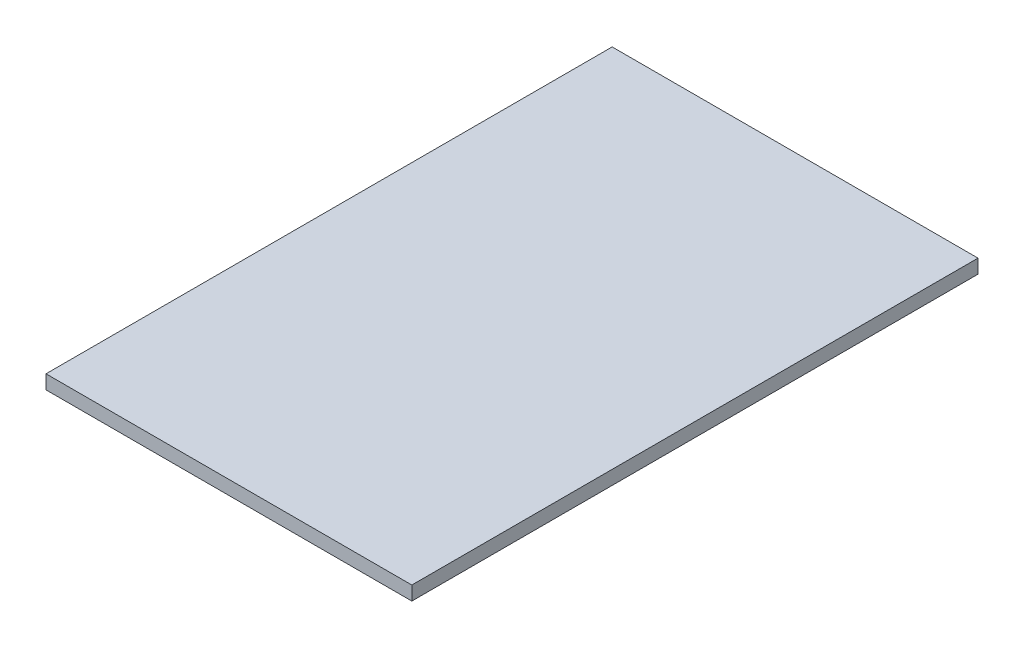
ISO-10303-21;
HEADER;
FILE_DESCRIPTION(('STEP AP214'),'2;1');
FILE_NAME('part.step','',(''),(''),'','','');
FILE_SCHEMA(('AUTOMOTIVE_DESIGN { 1 0 10303 214 1 1 1 1 }'));
ENDSEC;
DATA;
#1=APPLICATION_CONTEXT('core data for automotive mechanical design processes');
#2=APPLICATION_PROTOCOL_DEFINITION('international standard','automotive_design',2000,#1);
#3=PRODUCT_CONTEXT('',#1,'mechanical');
#4=PRODUCT('Part','Part','',(#3));
#5=PRODUCT_RELATED_PRODUCT_CATEGORY('part','',(#4));
#6=PRODUCT_DEFINITION_FORMATION('','',#4);
#7=PRODUCT_DEFINITION_CONTEXT('part definition',#1,'design');
#8=PRODUCT_DEFINITION('design','',#6,#7);
#9=PRODUCT_DEFINITION_SHAPE('','',#8);
#10=(LENGTH_UNIT() NAMED_UNIT(*) SI_UNIT(.MILLI.,.METRE.));
#11=(NAMED_UNIT(*) PLANE_ANGLE_UNIT() SI_UNIT($,.RADIAN.));
#12=(NAMED_UNIT(*) SI_UNIT($,.STERADIAN.) SOLID_ANGLE_UNIT());
#13=UNCERTAINTY_MEASURE_WITH_UNIT(LENGTH_MEASURE(1.E-05),#10,'distance_accuracy_value','');
#14=(GEOMETRIC_REPRESENTATION_CONTEXT(3) GLOBAL_UNCERTAINTY_ASSIGNED_CONTEXT((#13)) GLOBAL_UNIT_ASSIGNED_CONTEXT((#10,
#11,#12)) REPRESENTATION_CONTEXT('',''));
#15=CARTESIAN_POINT('',(0.,0.,0.));
#16=DIRECTION('',(0.,0.,1.));
#17=DIRECTION('',(1.,0.,0.));
#18=AXIS2_PLACEMENT_3D('',#15,#16,#17);
#19=CARTESIAN_POINT('',(21.,1.6,65.));
#20=DIRECTION('',(-1.,0.,0.));
#21=DIRECTION('',(0.,0.,1.));
#22=AXIS2_PLACEMENT_3D('',#19,#20,#21);
#23=PLANE('',#22);
#24=DIRECTION('',(0.,1.,0.));
#25=VECTOR('',#24,1.);
#26=CARTESIAN_POINT('',(21.,1.6,0.));
#27=LINE('',#26,#25);
#28=CARTESIAN_POINT('',(21.,0.,0.));
#29=VERTEX_POINT('',#28);
#30=CARTESIAN_POINT('',(21.,1.6,0.));
#31=VERTEX_POINT('',#30);
#32=EDGE_CURVE('E95',#29,#31,#27,.T.);
#33=ORIENTED_EDGE('',*,*,#32,.T.);
#34=DIRECTION('',(0.,0.,-1.));
#35=VECTOR('',#34,1.);
#36=CARTESIAN_POINT('',(21.,1.6,65.));
#37=LINE('',#36,#35);
#38=CARTESIAN_POINT('',(21.,1.6,65.));
#39=VERTEX_POINT('',#38);
#40=EDGE_CURVE('E11',#39,#31,#37,.T.);
#41=ORIENTED_EDGE('',*,*,#40,.F.);
#42=DIRECTION('',(0.,1.,0.));
#43=VECTOR('',#42,1.);
#44=CARTESIAN_POINT('',(21.,1.6,65.));
#45=LINE('',#44,#43);
#46=CARTESIAN_POINT('',(21.,0.,65.));
#47=VERTEX_POINT('',#46);
#48=EDGE_CURVE('E83',#47,#39,#45,.T.);
#49=ORIENTED_EDGE('',*,*,#48,.F.);
#50=DIRECTION('',(0.,0.,-1.));
#51=VECTOR('',#50,1.);
#52=CARTESIAN_POINT('',(21.,0.,65.));
#53=LINE('',#52,#51);
#54=EDGE_CURVE('E91',#47,#29,#53,.T.);
#55=ORIENTED_EDGE('',*,*,#54,.T.);
#56=EDGE_LOOP('',(#33,#41,#49,#55));
#57=FACE_BOUND('',#56,.T.);
#58=ADVANCED_FACE('F32',(#57),#23,.F.);
#59=CARTESIAN_POINT('',(-21.,1.6,65.));
#60=DIRECTION('',(0.,-1.,0.));
#61=DIRECTION('',(0.,0.,-1.));
#62=AXIS2_PLACEMENT_3D('',#59,#60,#61);
#63=PLANE('',#62);
#64=DIRECTION('',(-1.,0.,0.));
#65=VECTOR('',#64,1.);
#66=CARTESIAN_POINT('',(-21.,1.6,0.));
#67=LINE('',#66,#65);
#68=CARTESIAN_POINT('',(-21.,1.6,0.));
#69=VERTEX_POINT('',#68);
#70=EDGE_CURVE('E87',#31,#69,#67,.T.);
#71=ORIENTED_EDGE('',*,*,#70,.T.);
#72=DIRECTION('',(0.,0.,-1.));
#73=VECTOR('',#72,1.);
#74=CARTESIAN_POINT('',(-21.,1.6,65.));
#75=LINE('',#74,#73);
#76=CARTESIAN_POINT('',(-21.,1.6,65.));
#77=VERTEX_POINT('',#76);
#78=EDGE_CURVE('E40',#77,#69,#75,.T.);
#79=ORIENTED_EDGE('',*,*,#78,.F.);
#80=DIRECTION('',(-1.,0.,0.));
#81=VECTOR('',#80,1.);
#82=CARTESIAN_POINT('',(-21.,1.6,65.));
#83=LINE('',#82,#81);
#84=EDGE_CURVE('E78',#39,#77,#83,.T.);
#85=ORIENTED_EDGE('',*,*,#84,.F.);
#86=ORIENTED_EDGE('',*,*,#40,.T.);
#87=EDGE_LOOP('',(#71,#79,#85,#86));
#88=FACE_BOUND('',#87,.T.);
#89=ADVANCED_FACE('F86',(#88),#63,.F.);
#90=CARTESIAN_POINT('',(-21.,0.,65.));
#91=DIRECTION('',(1.,0.,0.));
#92=DIRECTION('',(0.,0.,-1.));
#93=AXIS2_PLACEMENT_3D('',#90,#91,#92);
#94=PLANE('',#93);
#95=DIRECTION('',(0.,-1.,0.));
#96=VECTOR('',#95,1.);
#97=CARTESIAN_POINT('',(-21.,0.,0.));
#98=LINE('',#97,#96);
#99=CARTESIAN_POINT('',(-21.,0.,0.));
#100=VERTEX_POINT('',#99);
#101=EDGE_CURVE('E65',#69,#100,#98,.T.);
#102=ORIENTED_EDGE('',*,*,#101,.T.);
#103=DIRECTION('',(0.,0.,-1.));
#104=VECTOR('',#103,1.);
#105=CARTESIAN_POINT('',(-21.,0.,65.));
#106=LINE('',#105,#104);
#107=CARTESIAN_POINT('',(-21.,0.,65.));
#108=VERTEX_POINT('',#107);
#109=EDGE_CURVE('E88',#108,#100,#106,.T.);
#110=ORIENTED_EDGE('',*,*,#109,.F.);
#111=DIRECTION('',(0.,-1.,0.));
#112=VECTOR('',#111,1.);
#113=CARTESIAN_POINT('',(-21.,0.,65.));
#114=LINE('',#113,#112);
#115=EDGE_CURVE('E81',#77,#108,#114,.T.);
#116=ORIENTED_EDGE('',*,*,#115,.F.);
#117=ORIENTED_EDGE('',*,*,#78,.T.);
#118=EDGE_LOOP('',(#102,#110,#116,#117));
#119=FACE_BOUND('',#118,.T.);
#120=ADVANCED_FACE('F89',(#119),#94,.F.);
#121=CARTESIAN_POINT('',(-21.,0.,65.));
#122=DIRECTION('',(0.,1.,0.));
#123=DIRECTION('',(0.,0.,1.));
#124=AXIS2_PLACEMENT_3D('',#121,#122,#123);
#125=PLANE('',#124);
#126=DIRECTION('',(1.,0.,0.));
#127=VECTOR('',#126,1.);
#128=CARTESIAN_POINT('',(-21.,0.,0.));
#129=LINE('',#128,#127);
#130=EDGE_CURVE('E71',#100,#29,#129,.T.);
#131=ORIENTED_EDGE('',*,*,#130,.T.);
#132=ORIENTED_EDGE('',*,*,#54,.F.);
#133=DIRECTION('',(1.,0.,0.));
#134=VECTOR('',#133,1.);
#135=CARTESIAN_POINT('',(-21.,0.,65.));
#136=LINE('',#135,#134);
#137=EDGE_CURVE('E48',#108,#47,#136,.T.);
#138=ORIENTED_EDGE('',*,*,#137,.F.);
#139=ORIENTED_EDGE('',*,*,#109,.T.);
#140=EDGE_LOOP('',(#131,#132,#138,#139));
#141=FACE_BOUND('',#140,.T.);
#142=ADVANCED_FACE('F102',(#141),#125,.F.);
#143=CARTESIAN_POINT('',(0.,0.,65.));
#144=DIRECTION('',(0.,0.,1.));
#145=DIRECTION('',(1.,0.,0.));
#146=AXIS2_PLACEMENT_3D('',#143,#144,#145);
#147=PLANE('',#146);
#148=ORIENTED_EDGE('',*,*,#48,.T.);
#149=ORIENTED_EDGE('',*,*,#84,.T.);
#150=ORIENTED_EDGE('',*,*,#115,.T.);
#151=ORIENTED_EDGE('',*,*,#137,.T.);
#152=EDGE_LOOP('',(#148,#149,#150,#151));
#153=FACE_BOUND('',#152,.T.);
#154=ADVANCED_FACE('F79',(#153),#147,.T.);
#155=CARTESIAN_POINT('',(0.,0.,0.));
#156=DIRECTION('',(0.,0.,1.));
#157=DIRECTION('',(1.,0.,0.));
#158=AXIS2_PLACEMENT_3D('',#155,#156,#157);
#159=PLANE('',#158);
#160=ORIENTED_EDGE('',*,*,#32,.F.);
#161=ORIENTED_EDGE('',*,*,#130,.F.);
#162=ORIENTED_EDGE('',*,*,#101,.F.);
#163=ORIENTED_EDGE('',*,*,#70,.F.);
#164=EDGE_LOOP('',(#160,#161,#162,#163));
#165=FACE_BOUND('',#164,.T.);
#166=ADVANCED_FACE('F105',(#165),#159,.F.);
#167=CLOSED_SHELL('',(#58,#89,#120,#142,#154,#166));
#168=MANIFOLD_SOLID_BREP('B2',#167);
#169=ADVANCED_BREP_SHAPE_REPRESENTATION('',(#18,#168),#14);
#170=SHAPE_DEFINITION_REPRESENTATION(#9,#169);
ENDSEC;
END-ISO-10303-21;
